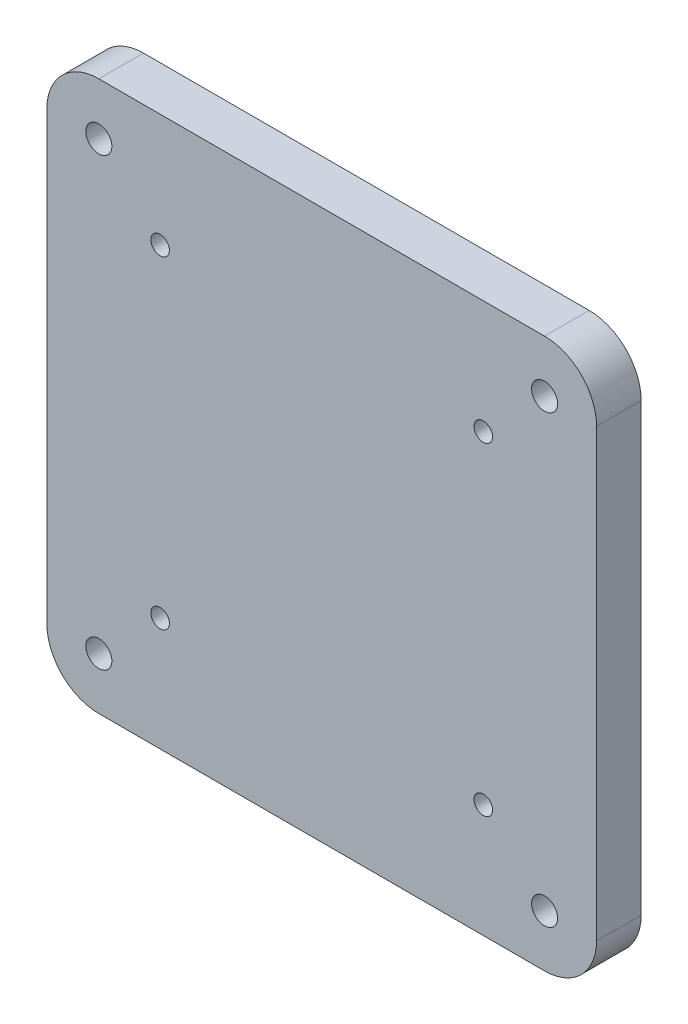
ISO-10303-21;
HEADER;
FILE_DESCRIPTION(('STEP AP214'),'2;1');
FILE_NAME('part.step','',(''),(''),'','','');
FILE_SCHEMA(('AUTOMOTIVE_DESIGN { 1 0 10303 214 1 1 1 1 }'));
ENDSEC;
DATA;
#1=APPLICATION_CONTEXT('core data for automotive mechanical design processes');
#2=APPLICATION_PROTOCOL_DEFINITION('international standard','automotive_design',2000,#1);
#3=PRODUCT_CONTEXT('',#1,'mechanical');
#4=PRODUCT('Part','Part','',(#3));
#5=PRODUCT_RELATED_PRODUCT_CATEGORY('part','',(#4));
#6=PRODUCT_DEFINITION_FORMATION('','',#4);
#7=PRODUCT_DEFINITION_CONTEXT('part definition',#1,'design');
#8=PRODUCT_DEFINITION('design','',#6,#7);
#9=PRODUCT_DEFINITION_SHAPE('','',#8);
#10=(LENGTH_UNIT() NAMED_UNIT(*) SI_UNIT(.MILLI.,.METRE.));
#11=(NAMED_UNIT(*) PLANE_ANGLE_UNIT() SI_UNIT($,.RADIAN.));
#12=(NAMED_UNIT(*) SI_UNIT($,.STERADIAN.) SOLID_ANGLE_UNIT());
#13=UNCERTAINTY_MEASURE_WITH_UNIT(LENGTH_MEASURE(1.E-05),#10,'distance_accuracy_value','');
#14=(GEOMETRIC_REPRESENTATION_CONTEXT(3) GLOBAL_UNCERTAINTY_ASSIGNED_CONTEXT((#13)) GLOBAL_UNIT_ASSIGNED_CONTEXT((#10,
#11,#12)) REPRESENTATION_CONTEXT('',''));
#15=CARTESIAN_POINT('',(0.,0.,0.));
#16=DIRECTION('',(0.,0.,1.));
#17=DIRECTION('',(1.,0.,0.));
#18=AXIS2_PLACEMENT_3D('',#15,#16,#17);
#19=CARTESIAN_POINT('',(0.,0.,6.));
#20=DIRECTION('',(0.,0.,1.));
#21=DIRECTION('',(1.,0.,0.));
#22=AXIS2_PLACEMENT_3D('',#19,#20,#21);
#23=PLANE('',#22);
#24=CARTESIAN_POINT('',(-30.,-30.,6.));
#25=DIRECTION('',(0.,0.,1.));
#26=DIRECTION('',(1.,0.,0.));
#27=AXIS2_PLACEMENT_3D('',#24,#25,#26);
#28=CIRCLE('',#27,1.75);
#29=CARTESIAN_POINT('',(-28.25,-30.,6.));
#30=VERTEX_POINT('',#29);
#31=EDGE_CURVE('E209',#30,#30,#28,.T.);
#32=ORIENTED_EDGE('',*,*,#31,.F.);
#33=EDGE_LOOP('',(#32));
#34=FACE_BOUND('',#33,.T.);
#35=CARTESIAN_POINT('',(21.75,-21.75,6.));
#36=DIRECTION('',(0.,0.,1.));
#37=DIRECTION('',(1.,0.,0.));
#38=AXIS2_PLACEMENT_3D('',#35,#36,#37);
#39=CIRCLE('',#38,1.25);
#40=CARTESIAN_POINT('',(23.,-21.75,6.));
#41=VERTEX_POINT('',#40);
#42=EDGE_CURVE('E197',#41,#41,#39,.T.);
#43=ORIENTED_EDGE('',*,*,#42,.F.);
#44=EDGE_LOOP('',(#43));
#45=FACE_BOUND('',#44,.T.);
#46=CARTESIAN_POINT('',(30.,30.,6.));
#47=DIRECTION('',(0.,0.,1.));
#48=DIRECTION('',(1.,0.,0.));
#49=AXIS2_PLACEMENT_3D('',#46,#47,#48);
#50=CIRCLE('',#49,1.75);
#51=CARTESIAN_POINT('',(31.75,30.,6.));
#52=VERTEX_POINT('',#51);
#53=EDGE_CURVE('E185',#52,#52,#50,.T.);
#54=ORIENTED_EDGE('',*,*,#53,.F.);
#55=EDGE_LOOP('',(#54));
#56=FACE_BOUND('',#55,.T.);
#57=CARTESIAN_POINT('',(-30.,30.,6.));
#58=DIRECTION('',(0.,0.,1.));
#59=DIRECTION('',(1.,0.,0.));
#60=AXIS2_PLACEMENT_3D('',#57,#58,#59);
#61=CIRCLE('',#60,1.75);
#62=CARTESIAN_POINT('',(-28.25,30.,6.));
#63=VERTEX_POINT('',#62);
#64=EDGE_CURVE('E168',#63,#63,#61,.T.);
#65=ORIENTED_EDGE('',*,*,#64,.F.);
#66=EDGE_LOOP('',(#65));
#67=FACE_BOUND('',#66,.T.);
#68=DIRECTION('',(0.,1.,0.));
#69=VECTOR('',#68,1.);
#70=CARTESIAN_POINT('',(37.,37.,6.));
#71=LINE('',#70,#69);
#72=CARTESIAN_POINT('',(37.,-30.,6.));
#73=VERTEX_POINT('',#72);
#74=CARTESIAN_POINT('',(37.,30.,6.));
#75=VERTEX_POINT('',#74);
#76=EDGE_CURVE('E175',#73,#75,#71,.T.);
#77=ORIENTED_EDGE('',*,*,#76,.T.);
#78=CARTESIAN_POINT('',(30.,30.,6.));
#79=DIRECTION('',(0.,0.,1.));
#80=DIRECTION('',(1.,0.,0.));
#81=AXIS2_PLACEMENT_3D('',#78,#79,#80);
#82=CIRCLE('',#81,7.);
#83=CARTESIAN_POINT('',(30.,37.,6.));
#84=VERTEX_POINT('',#83);
#85=EDGE_CURVE('E152',#75,#84,#82,.T.);
#86=ORIENTED_EDGE('',*,*,#85,.T.);
#87=DIRECTION('',(-1.,0.,0.));
#88=VECTOR('',#87,1.);
#89=CARTESIAN_POINT('',(-37.,37.,6.));
#90=LINE('',#89,#88);
#91=CARTESIAN_POINT('',(-30.,37.,6.));
#92=VERTEX_POINT('',#91);
#93=EDGE_CURVE('E123',#84,#92,#90,.T.);
#94=ORIENTED_EDGE('',*,*,#93,.T.);
#95=CARTESIAN_POINT('',(-30.,30.,6.));
#96=DIRECTION('',(0.,0.,1.));
#97=DIRECTION('',(1.,0.,0.));
#98=AXIS2_PLACEMENT_3D('',#95,#96,#97);
#99=CIRCLE('',#98,7.);
#100=CARTESIAN_POINT('',(-37.,30.,6.));
#101=VERTEX_POINT('',#100);
#102=EDGE_CURVE('E147',#92,#101,#99,.T.);
#103=ORIENTED_EDGE('',*,*,#102,.T.);
#104=DIRECTION('',(0.,-1.,0.));
#105=VECTOR('',#104,1.);
#106=CARTESIAN_POINT('',(-37.,37.,6.));
#107=LINE('',#106,#105);
#108=CARTESIAN_POINT('',(-37.,-30.,6.));
#109=VERTEX_POINT('',#108);
#110=EDGE_CURVE('E130',#101,#109,#107,.T.);
#111=ORIENTED_EDGE('',*,*,#110,.T.);
#112=CARTESIAN_POINT('',(-30.,-30.,6.));
#113=DIRECTION('',(0.,0.,1.));
#114=DIRECTION('',(1.,0.,0.));
#115=AXIS2_PLACEMENT_3D('',#112,#113,#114);
#116=CIRCLE('',#115,7.);
#117=CARTESIAN_POINT('',(-30.,-37.,6.));
#118=VERTEX_POINT('',#117);
#119=EDGE_CURVE('E59',#109,#118,#116,.T.);
#120=ORIENTED_EDGE('',*,*,#119,.T.);
#121=DIRECTION('',(1.,0.,0.));
#122=VECTOR('',#121,1.);
#123=CARTESIAN_POINT('',(-37.,-37.,6.));
#124=LINE('',#123,#122);
#125=CARTESIAN_POINT('',(30.,-37.,6.));
#126=VERTEX_POINT('',#125);
#127=EDGE_CURVE('E133',#118,#126,#124,.T.);
#128=ORIENTED_EDGE('',*,*,#127,.T.);
#129=CARTESIAN_POINT('',(30.,-30.,6.));
#130=DIRECTION('',(0.,0.,1.));
#131=DIRECTION('',(1.,0.,0.));
#132=AXIS2_PLACEMENT_3D('',#129,#130,#131);
#133=CIRCLE('',#132,7.);
#134=EDGE_CURVE('E150',#126,#73,#133,.T.);
#135=ORIENTED_EDGE('',*,*,#134,.T.);
#136=EDGE_LOOP('',(#77,#86,#94,#103,#111,#120,#128,#135));
#137=FACE_BOUND('',#136,.T.);
#138=CARTESIAN_POINT('',(-21.75,21.75,6.));
#139=DIRECTION('',(0.,0.,1.));
#140=DIRECTION('',(1.,0.,0.));
#141=AXIS2_PLACEMENT_3D('',#138,#139,#140);
#142=CIRCLE('',#141,1.25);
#143=CARTESIAN_POINT('',(-20.5,21.75,6.));
#144=VERTEX_POINT('',#143);
#145=EDGE_CURVE('E180',#144,#144,#142,.T.);
#146=ORIENTED_EDGE('',*,*,#145,.F.);
#147=EDGE_LOOP('',(#146));
#148=FACE_BOUND('',#147,.T.);
#149=CARTESIAN_POINT('',(21.75,21.75,6.));
#150=DIRECTION('',(0.,0.,1.));
#151=DIRECTION('',(1.,0.,0.));
#152=AXIS2_PLACEMENT_3D('',#149,#150,#151);
#153=CIRCLE('',#152,1.25);
#154=CARTESIAN_POINT('',(23.,21.75,6.));
#155=VERTEX_POINT('',#154);
#156=EDGE_CURVE('E191',#155,#155,#153,.T.);
#157=ORIENTED_EDGE('',*,*,#156,.F.);
#158=EDGE_LOOP('',(#157));
#159=FACE_BOUND('',#158,.T.);
#160=CARTESIAN_POINT('',(-21.75,-21.75,6.));
#161=DIRECTION('',(0.,0.,1.));
#162=DIRECTION('',(1.,0.,0.));
#163=AXIS2_PLACEMENT_3D('',#160,#161,#162);
#164=CIRCLE('',#163,1.25);
#165=CARTESIAN_POINT('',(-20.5,-21.75,6.));
#166=VERTEX_POINT('',#165);
#167=EDGE_CURVE('E203',#166,#166,#164,.T.);
#168=ORIENTED_EDGE('',*,*,#167,.F.);
#169=EDGE_LOOP('',(#168));
#170=FACE_BOUND('',#169,.T.);
#171=CARTESIAN_POINT('',(30.,-30.,6.));
#172=DIRECTION('',(0.,0.,1.));
#173=DIRECTION('',(1.,0.,0.));
#174=AXIS2_PLACEMENT_3D('',#171,#172,#173);
#175=CIRCLE('',#174,1.75);
#176=CARTESIAN_POINT('',(31.75,-30.,6.));
#177=VERTEX_POINT('',#176);
#178=EDGE_CURVE('E215',#177,#177,#175,.T.);
#179=ORIENTED_EDGE('',*,*,#178,.F.);
#180=EDGE_LOOP('',(#179));
#181=FACE_BOUND('',#180,.T.);
#182=ADVANCED_FACE('F37',(#34,#45,#56,#67,#137,#148,#159,#170,#181),#23,.T.);
#183=CARTESIAN_POINT('',(0.,0.,0.));
#184=DIRECTION('',(0.,0.,1.));
#185=DIRECTION('',(1.,0.,0.));
#186=AXIS2_PLACEMENT_3D('',#183,#184,#185);
#187=PLANE('',#186);
#188=DIRECTION('',(-1.,0.,0.));
#189=VECTOR('',#188,1.);
#190=CARTESIAN_POINT('',(-37.,37.,0.));
#191=LINE('',#190,#189);
#192=CARTESIAN_POINT('',(30.,37.,0.));
#193=VERTEX_POINT('',#192);
#194=CARTESIAN_POINT('',(-30.,37.,0.));
#195=VERTEX_POINT('',#194);
#196=EDGE_CURVE('E120',#193,#195,#191,.T.);
#197=ORIENTED_EDGE('',*,*,#196,.F.);
#198=CARTESIAN_POINT('',(30.,30.,0.));
#199=DIRECTION('',(0.,0.,1.));
#200=DIRECTION('',(1.,0.,0.));
#201=AXIS2_PLACEMENT_3D('',#198,#199,#200);
#202=CIRCLE('',#201,7.);
#203=CARTESIAN_POINT('',(37.,30.,0.));
#204=VERTEX_POINT('',#203);
#205=EDGE_CURVE('E103',#193,#204,#202,.F.);
#206=ORIENTED_EDGE('',*,*,#205,.T.);
#207=DIRECTION('',(0.,1.,0.));
#208=VECTOR('',#207,1.);
#209=CARTESIAN_POINT('',(37.,37.,0.));
#210=LINE('',#209,#208);
#211=CARTESIAN_POINT('',(37.,-30.,0.));
#212=VERTEX_POINT('',#211);
#213=EDGE_CURVE('E131',#212,#204,#210,.T.);
#214=ORIENTED_EDGE('',*,*,#213,.F.);
#215=CARTESIAN_POINT('',(30.,-30.,0.));
#216=DIRECTION('',(0.,0.,1.));
#217=DIRECTION('',(1.,0.,0.));
#218=AXIS2_PLACEMENT_3D('',#215,#216,#217);
#219=CIRCLE('',#218,7.);
#220=CARTESIAN_POINT('',(30.,-37.,0.));
#221=VERTEX_POINT('',#220);
#222=EDGE_CURVE('E114',#212,#221,#219,.F.);
#223=ORIENTED_EDGE('',*,*,#222,.T.);
#224=DIRECTION('',(1.,0.,0.));
#225=VECTOR('',#224,1.);
#226=CARTESIAN_POINT('',(-37.,-37.,0.));
#227=LINE('',#226,#225);
#228=CARTESIAN_POINT('',(-30.,-37.,0.));
#229=VERTEX_POINT('',#228);
#230=EDGE_CURVE('E135',#229,#221,#227,.T.);
#231=ORIENTED_EDGE('',*,*,#230,.F.);
#232=CARTESIAN_POINT('',(-30.,-30.,0.));
#233=DIRECTION('',(0.,0.,1.));
#234=DIRECTION('',(1.,0.,0.));
#235=AXIS2_PLACEMENT_3D('',#232,#233,#234);
#236=CIRCLE('',#235,7.);
#237=CARTESIAN_POINT('',(-37.,-30.,0.));
#238=VERTEX_POINT('',#237);
#239=EDGE_CURVE('E141',#229,#238,#236,.F.);
#240=ORIENTED_EDGE('',*,*,#239,.T.);
#241=DIRECTION('',(0.,-1.,0.));
#242=VECTOR('',#241,1.);
#243=CARTESIAN_POINT('',(-37.,37.,0.));
#244=LINE('',#243,#242);
#245=CARTESIAN_POINT('',(-37.,30.,0.));
#246=VERTEX_POINT('',#245);
#247=EDGE_CURVE('E163',#246,#238,#244,.T.);
#248=ORIENTED_EDGE('',*,*,#247,.F.);
#249=CARTESIAN_POINT('',(-30.,30.,0.));
#250=DIRECTION('',(0.,0.,1.));
#251=DIRECTION('',(1.,0.,0.));
#252=AXIS2_PLACEMENT_3D('',#249,#250,#251);
#253=CIRCLE('',#252,7.);
#254=EDGE_CURVE('E124',#246,#195,#253,.F.);
#255=ORIENTED_EDGE('',*,*,#254,.T.);
#256=EDGE_LOOP('',(#197,#206,#214,#223,#231,#240,#248,#255));
#257=FACE_BOUND('',#256,.T.);
#258=CARTESIAN_POINT('',(-30.,30.,0.));
#259=DIRECTION('',(0.,0.,1.));
#260=DIRECTION('',(1.,0.,0.));
#261=AXIS2_PLACEMENT_3D('',#258,#259,#260);
#262=CIRCLE('',#261,1.75);
#263=CARTESIAN_POINT('',(-28.25,30.,0.));
#264=VERTEX_POINT('',#263);
#265=EDGE_CURVE('E171',#264,#264,#262,.T.);
#266=ORIENTED_EDGE('',*,*,#265,.T.);
#267=EDGE_LOOP('',(#266));
#268=FACE_BOUND('',#267,.T.);
#269=CARTESIAN_POINT('',(-21.75,21.75,0.));
#270=DIRECTION('',(0.,0.,1.));
#271=DIRECTION('',(1.,0.,0.));
#272=AXIS2_PLACEMENT_3D('',#269,#270,#271);
#273=CIRCLE('',#272,1.25);
#274=CARTESIAN_POINT('',(-20.5,21.75,0.));
#275=VERTEX_POINT('',#274);
#276=EDGE_CURVE('E182',#275,#275,#273,.T.);
#277=ORIENTED_EDGE('',*,*,#276,.T.);
#278=EDGE_LOOP('',(#277));
#279=FACE_BOUND('',#278,.T.);
#280=CARTESIAN_POINT('',(30.,30.,0.));
#281=DIRECTION('',(0.,0.,1.));
#282=DIRECTION('',(1.,0.,0.));
#283=AXIS2_PLACEMENT_3D('',#280,#281,#282);
#284=CIRCLE('',#283,1.75);
#285=CARTESIAN_POINT('',(31.75,30.,0.));
#286=VERTEX_POINT('',#285);
#287=EDGE_CURVE('E188',#286,#286,#284,.T.);
#288=ORIENTED_EDGE('',*,*,#287,.T.);
#289=EDGE_LOOP('',(#288));
#290=FACE_BOUND('',#289,.T.);
#291=CARTESIAN_POINT('',(21.75,21.75,0.));
#292=DIRECTION('',(0.,0.,1.));
#293=DIRECTION('',(1.,0.,0.));
#294=AXIS2_PLACEMENT_3D('',#291,#292,#293);
#295=CIRCLE('',#294,1.25);
#296=CARTESIAN_POINT('',(23.,21.75,0.));
#297=VERTEX_POINT('',#296);
#298=EDGE_CURVE('E194',#297,#297,#295,.T.);
#299=ORIENTED_EDGE('',*,*,#298,.T.);
#300=EDGE_LOOP('',(#299));
#301=FACE_BOUND('',#300,.T.);
#302=CARTESIAN_POINT('',(21.75,-21.75,0.));
#303=DIRECTION('',(0.,0.,1.));
#304=DIRECTION('',(1.,0.,0.));
#305=AXIS2_PLACEMENT_3D('',#302,#303,#304);
#306=CIRCLE('',#305,1.25);
#307=CARTESIAN_POINT('',(23.,-21.75,0.));
#308=VERTEX_POINT('',#307);
#309=EDGE_CURVE('E200',#308,#308,#306,.T.);
#310=ORIENTED_EDGE('',*,*,#309,.T.);
#311=EDGE_LOOP('',(#310));
#312=FACE_BOUND('',#311,.T.);
#313=CARTESIAN_POINT('',(-21.75,-21.75,0.));
#314=DIRECTION('',(0.,0.,1.));
#315=DIRECTION('',(1.,0.,0.));
#316=AXIS2_PLACEMENT_3D('',#313,#314,#315);
#317=CIRCLE('',#316,1.25);
#318=CARTESIAN_POINT('',(-20.5,-21.75,0.));
#319=VERTEX_POINT('',#318);
#320=EDGE_CURVE('E206',#319,#319,#317,.T.);
#321=ORIENTED_EDGE('',*,*,#320,.T.);
#322=EDGE_LOOP('',(#321));
#323=FACE_BOUND('',#322,.T.);
#324=CARTESIAN_POINT('',(-30.,-30.,0.));
#325=DIRECTION('',(0.,0.,1.));
#326=DIRECTION('',(1.,0.,0.));
#327=AXIS2_PLACEMENT_3D('',#324,#325,#326);
#328=CIRCLE('',#327,1.75);
#329=CARTESIAN_POINT('',(-28.25,-30.,0.));
#330=VERTEX_POINT('',#329);
#331=EDGE_CURVE('E212',#330,#330,#328,.T.);
#332=ORIENTED_EDGE('',*,*,#331,.T.);
#333=EDGE_LOOP('',(#332));
#334=FACE_BOUND('',#333,.T.);
#335=CARTESIAN_POINT('',(30.,-30.,0.));
#336=DIRECTION('',(0.,0.,1.));
#337=DIRECTION('',(1.,0.,0.));
#338=AXIS2_PLACEMENT_3D('',#335,#336,#337);
#339=CIRCLE('',#338,1.75);
#340=CARTESIAN_POINT('',(31.75,-30.,0.));
#341=VERTEX_POINT('',#340);
#342=EDGE_CURVE('E218',#341,#341,#339,.T.);
#343=ORIENTED_EDGE('',*,*,#342,.T.);
#344=EDGE_LOOP('',(#343));
#345=FACE_BOUND('',#344,.T.);
#346=ADVANCED_FACE('F127',(#257,#268,#279,#290,#301,#312,#323,#334,#345),#187,.F.);
#347=CARTESIAN_POINT('',(-37.,37.,6.));
#348=DIRECTION('',(1.,0.,0.));
#349=DIRECTION('',(0.,1.,0.));
#350=AXIS2_PLACEMENT_3D('',#347,#348,#349);
#351=PLANE('',#350);
#352=ORIENTED_EDGE('',*,*,#247,.T.);
#353=DIRECTION('',(0.,0.,-1.));
#354=VECTOR('',#353,1.);
#355=CARTESIAN_POINT('',(-37.,-30.,6.));
#356=LINE('',#355,#354);
#357=EDGE_CURVE('E11',#238,#109,#356,.F.);
#358=ORIENTED_EDGE('',*,*,#357,.T.);
#359=ORIENTED_EDGE('',*,*,#110,.F.);
#360=DIRECTION('',(0.,0.,-1.));
#361=VECTOR('',#360,1.);
#362=CARTESIAN_POINT('',(-37.,30.,6.));
#363=LINE('',#362,#361);
#364=EDGE_CURVE('E45',#101,#246,#363,.T.);
#365=ORIENTED_EDGE('',*,*,#364,.T.);
#366=EDGE_LOOP('',(#352,#358,#359,#365));
#367=FACE_BOUND('',#366,.T.);
#368=ADVANCED_FACE('F162',(#367),#351,.F.);
#369=CARTESIAN_POINT('',(-37.,-37.,6.));
#370=DIRECTION('',(0.,1.,0.));
#371=DIRECTION('',(0.,0.,1.));
#372=AXIS2_PLACEMENT_3D('',#369,#370,#371);
#373=PLANE('',#372);
#374=ORIENTED_EDGE('',*,*,#230,.T.);
#375=DIRECTION('',(0.,0.,-1.));
#376=VECTOR('',#375,1.);
#377=CARTESIAN_POINT('',(30.,-37.,6.));
#378=LINE('',#377,#376);
#379=EDGE_CURVE('E52',#221,#126,#378,.F.);
#380=ORIENTED_EDGE('',*,*,#379,.T.);
#381=ORIENTED_EDGE('',*,*,#127,.F.);
#382=DIRECTION('',(0.,0.,-1.));
#383=VECTOR('',#382,1.);
#384=CARTESIAN_POINT('',(-30.,-37.,6.));
#385=LINE('',#384,#383);
#386=EDGE_CURVE('E154',#118,#229,#385,.T.);
#387=ORIENTED_EDGE('',*,*,#386,.T.);
#388=EDGE_LOOP('',(#374,#380,#381,#387));
#389=FACE_BOUND('',#388,.T.);
#390=ADVANCED_FACE('F245',(#389),#373,.F.);
#391=CARTESIAN_POINT('',(37.,37.,6.));
#392=DIRECTION('',(-1.,0.,0.));
#393=DIRECTION('',(0.,-1.,0.));
#394=AXIS2_PLACEMENT_3D('',#391,#392,#393);
#395=PLANE('',#394);
#396=ORIENTED_EDGE('',*,*,#213,.T.);
#397=DIRECTION('',(0.,0.,-1.));
#398=VECTOR('',#397,1.);
#399=CARTESIAN_POINT('',(37.,30.,6.));
#400=LINE('',#399,#398);
#401=EDGE_CURVE('E108',#204,#75,#400,.F.);
#402=ORIENTED_EDGE('',*,*,#401,.T.);
#403=ORIENTED_EDGE('',*,*,#76,.F.);
#404=DIRECTION('',(0.,0.,-1.));
#405=VECTOR('',#404,1.);
#406=CARTESIAN_POINT('',(37.,-30.,6.));
#407=LINE('',#406,#405);
#408=EDGE_CURVE('E113',#73,#212,#407,.T.);
#409=ORIENTED_EDGE('',*,*,#408,.T.);
#410=EDGE_LOOP('',(#396,#402,#403,#409));
#411=FACE_BOUND('',#410,.T.);
#412=ADVANCED_FACE('F242',(#411),#395,.F.);
#413=CARTESIAN_POINT('',(-37.,37.,6.));
#414=DIRECTION('',(0.,-1.,0.));
#415=DIRECTION('',(0.,0.,-1.));
#416=AXIS2_PLACEMENT_3D('',#413,#414,#415);
#417=PLANE('',#416);
#418=ORIENTED_EDGE('',*,*,#93,.F.);
#419=DIRECTION('',(0.,0.,-1.));
#420=VECTOR('',#419,1.);
#421=CARTESIAN_POINT('',(30.,37.,6.));
#422=LINE('',#421,#420);
#423=EDGE_CURVE('E107',#84,#193,#422,.T.);
#424=ORIENTED_EDGE('',*,*,#423,.T.);
#425=ORIENTED_EDGE('',*,*,#196,.T.);
#426=DIRECTION('',(0.,0.,-1.));
#427=VECTOR('',#426,1.);
#428=CARTESIAN_POINT('',(-30.,37.,6.));
#429=LINE('',#428,#427);
#430=EDGE_CURVE('E125',#195,#92,#429,.F.);
#431=ORIENTED_EDGE('',*,*,#430,.T.);
#432=EDGE_LOOP('',(#418,#424,#425,#431));
#433=FACE_BOUND('',#432,.T.);
#434=ADVANCED_FACE('F119',(#433),#417,.F.);
#435=CARTESIAN_POINT('',(-30.,30.,6.));
#436=DIRECTION('',(0.,0.,-1.));
#437=DIRECTION('',(-1.,0.,0.));
#438=AXIS2_PLACEMENT_3D('',#435,#436,#437);
#439=CYLINDRICAL_SURFACE('',#438,1.75);
#440=ORIENTED_EDGE('',*,*,#64,.T.);
#441=EDGE_LOOP('',(#440));
#442=FACE_BOUND('',#441,.T.);
#443=ORIENTED_EDGE('',*,*,#265,.F.);
#444=EDGE_LOOP('',(#443));
#445=FACE_BOUND('',#444,.T.);
#446=ADVANCED_FACE('F237',(#442,#445),#439,.F.);
#447=CARTESIAN_POINT('',(-21.75,21.75,6.));
#448=DIRECTION('',(0.,0.,-1.));
#449=DIRECTION('',(-1.,0.,0.));
#450=AXIS2_PLACEMENT_3D('',#447,#448,#449);
#451=CYLINDRICAL_SURFACE('',#450,1.25);
#452=ORIENTED_EDGE('',*,*,#145,.T.);
#453=EDGE_LOOP('',(#452));
#454=FACE_BOUND('',#453,.T.);
#455=ORIENTED_EDGE('',*,*,#276,.F.);
#456=EDGE_LOOP('',(#455));
#457=FACE_BOUND('',#456,.T.);
#458=ADVANCED_FACE('F302',(#454,#457),#451,.F.);
#459=CARTESIAN_POINT('',(30.,30.,6.));
#460=DIRECTION('',(0.,0.,-1.));
#461=DIRECTION('',(-1.,0.,0.));
#462=AXIS2_PLACEMENT_3D('',#459,#460,#461);
#463=CYLINDRICAL_SURFACE('',#462,1.75);
#464=ORIENTED_EDGE('',*,*,#53,.T.);
#465=EDGE_LOOP('',(#464));
#466=FACE_BOUND('',#465,.T.);
#467=ORIENTED_EDGE('',*,*,#287,.F.);
#468=EDGE_LOOP('',(#467));
#469=FACE_BOUND('',#468,.T.);
#470=ADVANCED_FACE('F299',(#466,#469),#463,.F.);
#471=CARTESIAN_POINT('',(21.75,21.75,6.));
#472=DIRECTION('',(0.,0.,-1.));
#473=DIRECTION('',(-1.,0.,0.));
#474=AXIS2_PLACEMENT_3D('',#471,#472,#473);
#475=CYLINDRICAL_SURFACE('',#474,1.25);
#476=ORIENTED_EDGE('',*,*,#156,.T.);
#477=EDGE_LOOP('',(#476));
#478=FACE_BOUND('',#477,.T.);
#479=ORIENTED_EDGE('',*,*,#298,.F.);
#480=EDGE_LOOP('',(#479));
#481=FACE_BOUND('',#480,.T.);
#482=ADVANCED_FACE('F295',(#478,#481),#475,.F.);
#483=CARTESIAN_POINT('',(21.75,-21.75,6.));
#484=DIRECTION('',(0.,0.,-1.));
#485=DIRECTION('',(-1.,0.,0.));
#486=AXIS2_PLACEMENT_3D('',#483,#484,#485);
#487=CYLINDRICAL_SURFACE('',#486,1.25);
#488=ORIENTED_EDGE('',*,*,#42,.T.);
#489=EDGE_LOOP('',(#488));
#490=FACE_BOUND('',#489,.T.);
#491=ORIENTED_EDGE('',*,*,#309,.F.);
#492=EDGE_LOOP('',(#491));
#493=FACE_BOUND('',#492,.T.);
#494=ADVANCED_FACE('F277',(#490,#493),#487,.F.);
#495=CARTESIAN_POINT('',(-21.75,-21.75,6.));
#496=DIRECTION('',(0.,0.,-1.));
#497=DIRECTION('',(-1.,0.,0.));
#498=AXIS2_PLACEMENT_3D('',#495,#496,#497);
#499=CYLINDRICAL_SURFACE('',#498,1.25);
#500=ORIENTED_EDGE('',*,*,#167,.T.);
#501=EDGE_LOOP('',(#500));
#502=FACE_BOUND('',#501,.T.);
#503=ORIENTED_EDGE('',*,*,#320,.F.);
#504=EDGE_LOOP('',(#503));
#505=FACE_BOUND('',#504,.T.);
#506=ADVANCED_FACE('F273',(#502,#505),#499,.F.);
#507=CARTESIAN_POINT('',(-30.,-30.,6.));
#508=DIRECTION('',(0.,0.,-1.));
#509=DIRECTION('',(-1.,0.,0.));
#510=AXIS2_PLACEMENT_3D('',#507,#508,#509);
#511=CYLINDRICAL_SURFACE('',#510,1.75);
#512=ORIENTED_EDGE('',*,*,#31,.T.);
#513=EDGE_LOOP('',(#512));
#514=FACE_BOUND('',#513,.T.);
#515=ORIENTED_EDGE('',*,*,#331,.F.);
#516=EDGE_LOOP('',(#515));
#517=FACE_BOUND('',#516,.T.);
#518=ADVANCED_FACE('F276',(#514,#517),#511,.F.);
#519=CARTESIAN_POINT('',(30.,-30.,6.));
#520=DIRECTION('',(0.,0.,-1.));
#521=DIRECTION('',(-1.,0.,0.));
#522=AXIS2_PLACEMENT_3D('',#519,#520,#521);
#523=CYLINDRICAL_SURFACE('',#522,1.75);
#524=ORIENTED_EDGE('',*,*,#178,.T.);
#525=EDGE_LOOP('',(#524));
#526=FACE_BOUND('',#525,.T.);
#527=ORIENTED_EDGE('',*,*,#342,.F.);
#528=EDGE_LOOP('',(#527));
#529=FACE_BOUND('',#528,.T.);
#530=ADVANCED_FACE('F224',(#526,#529),#523,.F.);
#531=CARTESIAN_POINT('',(30.,30.,6.));
#532=DIRECTION('',(0.,0.,-1.));
#533=DIRECTION('',(-1.,0.,0.));
#534=AXIS2_PLACEMENT_3D('',#531,#532,#533);
#535=CYLINDRICAL_SURFACE('',#534,7.);
#536=ORIENTED_EDGE('',*,*,#85,.F.);
#537=ORIENTED_EDGE('',*,*,#401,.F.);
#538=ORIENTED_EDGE('',*,*,#205,.F.);
#539=ORIENTED_EDGE('',*,*,#423,.F.);
#540=EDGE_LOOP('',(#536,#537,#538,#539));
#541=FACE_BOUND('',#540,.T.);
#542=ADVANCED_FACE('F106',(#541),#535,.T.);
#543=CARTESIAN_POINT('',(30.,-30.,6.));
#544=DIRECTION('',(0.,0.,-1.));
#545=DIRECTION('',(-1.,0.,0.));
#546=AXIS2_PLACEMENT_3D('',#543,#544,#545);
#547=CYLINDRICAL_SURFACE('',#546,7.);
#548=ORIENTED_EDGE('',*,*,#134,.F.);
#549=ORIENTED_EDGE('',*,*,#379,.F.);
#550=ORIENTED_EDGE('',*,*,#222,.F.);
#551=ORIENTED_EDGE('',*,*,#408,.F.);
#552=EDGE_LOOP('',(#548,#549,#550,#551));
#553=FACE_BOUND('',#552,.T.);
#554=ADVANCED_FACE('F253',(#553),#547,.T.);
#555=CARTESIAN_POINT('',(-30.,-30.,6.));
#556=DIRECTION('',(0.,0.,-1.));
#557=DIRECTION('',(-1.,0.,0.));
#558=AXIS2_PLACEMENT_3D('',#555,#556,#557);
#559=CYLINDRICAL_SURFACE('',#558,7.);
#560=ORIENTED_EDGE('',*,*,#119,.F.);
#561=ORIENTED_EDGE('',*,*,#357,.F.);
#562=ORIENTED_EDGE('',*,*,#239,.F.);
#563=ORIENTED_EDGE('',*,*,#386,.F.);
#564=EDGE_LOOP('',(#560,#561,#562,#563));
#565=FACE_BOUND('',#564,.T.);
#566=ADVANCED_FACE('F255',(#565),#559,.T.);
#567=CARTESIAN_POINT('',(-30.,30.,6.));
#568=DIRECTION('',(0.,0.,-1.));
#569=DIRECTION('',(-1.,0.,0.));
#570=AXIS2_PLACEMENT_3D('',#567,#568,#569);
#571=CYLINDRICAL_SURFACE('',#570,7.);
#572=ORIENTED_EDGE('',*,*,#102,.F.);
#573=ORIENTED_EDGE('',*,*,#430,.F.);
#574=ORIENTED_EDGE('',*,*,#254,.F.);
#575=ORIENTED_EDGE('',*,*,#364,.F.);
#576=EDGE_LOOP('',(#572,#573,#574,#575));
#577=FACE_BOUND('',#576,.T.);
#578=ADVANCED_FACE('F39',(#577),#571,.T.);
#579=CLOSED_SHELL('',(#182,#346,#368,#390,#412,#434,#446,#458,#470,#482,#494,#506,#518,#530,
#542,#554,#566,#578));
#580=MANIFOLD_SOLID_BREP('B2',#579);
#581=ADVANCED_BREP_SHAPE_REPRESENTATION('',(#18,#580),#14);
#582=SHAPE_DEFINITION_REPRESENTATION(#9,#581);
ENDSEC;
END-ISO-10303-21;
